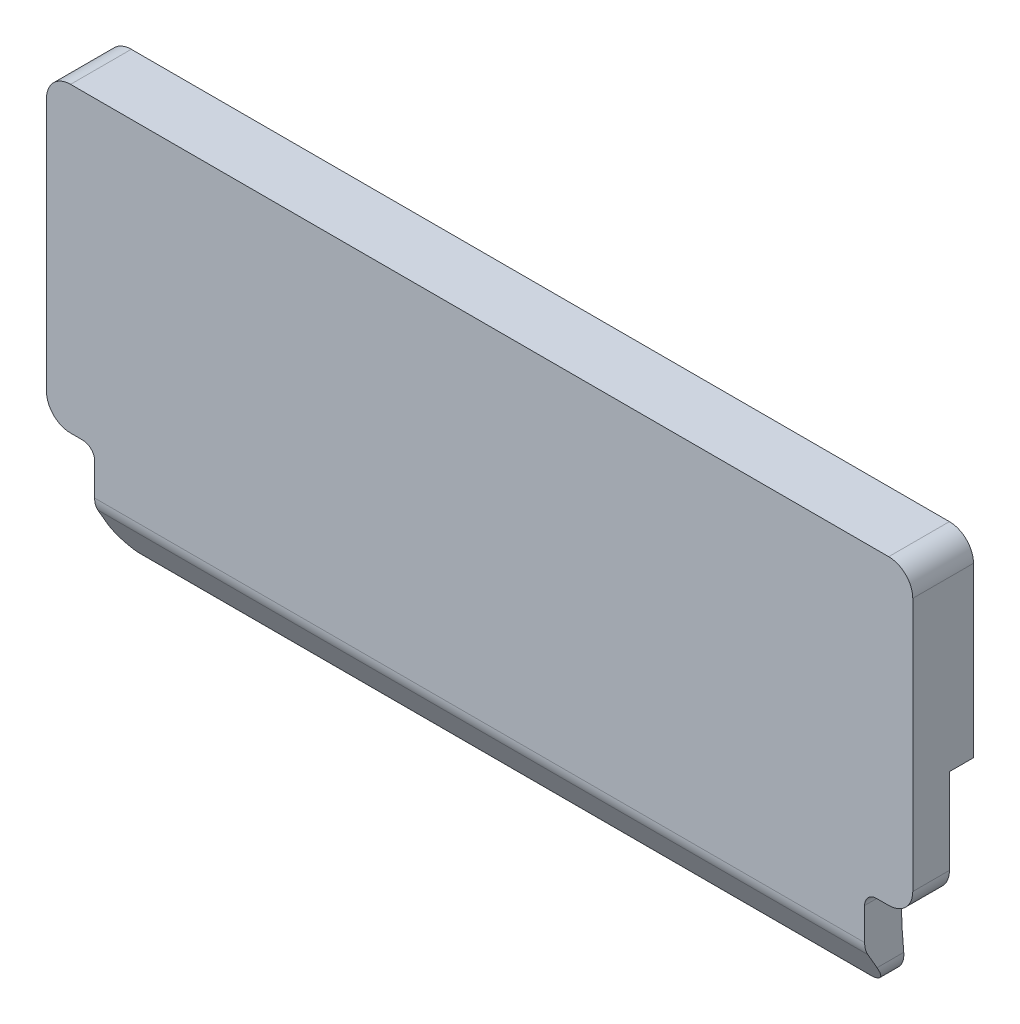
ISO-10303-21;
HEADER;
FILE_DESCRIPTION(('STEP AP214'),'2;1');
FILE_NAME('part.step','',(''),(''),'','','');
FILE_SCHEMA(('AUTOMOTIVE_DESIGN { 1 0 10303 214 1 1 1 1 }'));
ENDSEC;
DATA;
#1=APPLICATION_CONTEXT('core data for automotive mechanical design processes');
#2=APPLICATION_PROTOCOL_DEFINITION('international standard','automotive_design',2000,#1);
#3=PRODUCT_CONTEXT('',#1,'mechanical');
#4=PRODUCT('Part','Part','',(#3));
#5=PRODUCT_RELATED_PRODUCT_CATEGORY('part','',(#4));
#6=PRODUCT_DEFINITION_FORMATION('','',#4);
#7=PRODUCT_DEFINITION_CONTEXT('part definition',#1,'design');
#8=PRODUCT_DEFINITION('design','',#6,#7);
#9=PRODUCT_DEFINITION_SHAPE('','',#8);
#10=(LENGTH_UNIT() NAMED_UNIT(*) SI_UNIT(.MILLI.,.METRE.));
#11=(NAMED_UNIT(*) PLANE_ANGLE_UNIT() SI_UNIT($,.RADIAN.));
#12=(NAMED_UNIT(*) SI_UNIT($,.STERADIAN.) SOLID_ANGLE_UNIT());
#13=UNCERTAINTY_MEASURE_WITH_UNIT(LENGTH_MEASURE(1.E-05),#10,'distance_accuracy_value','');
#14=(GEOMETRIC_REPRESENTATION_CONTEXT(3) GLOBAL_UNCERTAINTY_ASSIGNED_CONTEXT((#13)) GLOBAL_UNIT_ASSIGNED_CONTEXT((#10,
#11,#12)) REPRESENTATION_CONTEXT('',''));
#15=CARTESIAN_POINT('',(0.,0.,0.));
#16=DIRECTION('',(0.,0.,1.));
#17=DIRECTION('',(1.,0.,0.));
#18=AXIS2_PLACEMENT_3D('',#15,#16,#17);
#19=CARTESIAN_POINT('',(16.9999681612747,17.3034644433608,-1.2));
#20=DIRECTION('',(0.,0.,1.));
#21=DIRECTION('',(1.,0.,0.));
#22=AXIS2_PLACEMENT_3D('',#19,#20,#21);
#23=CYLINDRICAL_SURFACE('',#22,1.);
#24=DIRECTION('',(0.,0.,1.));
#25=VECTOR('',#24,1.);
#26=CARTESIAN_POINT('',(17.9999681612747,17.3034644433608,-1.2));
#27=LINE('',#26,#25);
#28=CARTESIAN_POINT('',(17.9999681612747,17.3034644433608,-1.02379666372447));
#29=VERTEX_POINT('',#28);
#30=CARTESIAN_POINT('',(17.9999681612747,17.3034644433608,1.5));
#31=VERTEX_POINT('',#30);
#32=EDGE_CURVE('E377',#29,#31,#27,.T.);
#33=ORIENTED_EDGE('',*,*,#32,.F.);
#34=CARTESIAN_POINT('',(16.9999681612747,17.3034644433608,-1.02379666372447));
#35=DIRECTION('',(0.,0.,-1.));
#36=DIRECTION('',(-1.,0.,0.));
#37=AXIS2_PLACEMENT_3D('',#34,#35,#36);
#38=CIRCLE('',#37,1.);
#39=CARTESIAN_POINT('',(16.9999681612747,18.3034644433608,-1.02379666372447));
#40=VERTEX_POINT('',#39);
#41=EDGE_CURVE('E201',#29,#40,#38,.F.);
#42=ORIENTED_EDGE('',*,*,#41,.T.);
#43=DIRECTION('',(0.,0.,1.));
#44=VECTOR('',#43,1.);
#45=CARTESIAN_POINT('',(16.9999681612747,18.3034644433608,-1.2));
#46=LINE('',#45,#44);
#47=CARTESIAN_POINT('',(16.9999681612747,18.3034644433608,1.5));
#48=VERTEX_POINT('',#47);
#49=EDGE_CURVE('E376',#40,#48,#46,.T.);
#50=ORIENTED_EDGE('',*,*,#49,.T.);
#51=CARTESIAN_POINT('',(16.9999681612747,17.3034644433608,1.5));
#52=DIRECTION('',(0.,0.,1.));
#53=DIRECTION('',(1.,0.,0.));
#54=AXIS2_PLACEMENT_3D('',#51,#52,#53);
#55=CIRCLE('',#54,1.);
#56=EDGE_CURVE('E334',#31,#48,#55,.T.);
#57=ORIENTED_EDGE('',*,*,#56,.F.);
#58=EDGE_LOOP('',(#33,#42,#50,#57));
#59=FACE_BOUND('',#58,.T.);
#60=ADVANCED_FACE('F35',(#59),#23,.T.);
#61=CARTESIAN_POINT('',(17.9999681612747,9.3034644433608,-1.2));
#62=DIRECTION('',(1.,0.,0.));
#63=DIRECTION('',(0.,0.,-1.));
#64=AXIS2_PLACEMENT_3D('',#61,#62,#63);
#65=PLANE('',#64);
#66=DIRECTION('',(0.,0.,-1.));
#67=VECTOR('',#66,1.);
#68=CARTESIAN_POINT('',(17.9999681612747,10.3045378238837,0.));
#69=LINE('',#68,#67);
#70=CARTESIAN_POINT('',(17.9999681612747,10.3045378238837,-0.023796663724471));
#71=VERTEX_POINT('',#70);
#72=CARTESIAN_POINT('',(17.9999681612747,10.3045378238837,-1.02379666372447));
#73=VERTEX_POINT('',#72);
#74=EDGE_CURVE('E188',#71,#73,#69,.T.);
#75=ORIENTED_EDGE('',*,*,#74,.T.);
#76=DIRECTION('',(0.,1.,0.));
#77=VECTOR('',#76,1.);
#78=CARTESIAN_POINT('',(17.9999681612747,0.,-1.02379666372447));
#79=LINE('',#78,#77);
#80=EDGE_CURVE('E198',#73,#29,#79,.T.);
#81=ORIENTED_EDGE('',*,*,#80,.T.);
#82=ORIENTED_EDGE('',*,*,#32,.T.);
#83=DIRECTION('',(0.,1.,0.));
#84=VECTOR('',#83,1.);
#85=CARTESIAN_POINT('',(17.9999681612747,9.3034644433608,1.5));
#86=LINE('',#85,#84);
#87=CARTESIAN_POINT('',(17.9999681612747,6.7511744579321,1.5));
#88=VERTEX_POINT('',#87);
#89=EDGE_CURVE('E373',#88,#31,#86,.T.);
#90=ORIENTED_EDGE('',*,*,#89,.F.);
#91=DIRECTION('',(0.,0.,1.));
#92=VECTOR('',#91,1.);
#93=CARTESIAN_POINT('',(17.9999681612747,6.7511744579321,-1.2));
#94=LINE('',#93,#92);
#95=CARTESIAN_POINT('',(17.9999681612747,6.7511744579321,-0.0237966637244845));
#96=VERTEX_POINT('',#95);
#97=EDGE_CURVE('E380',#96,#88,#94,.T.);
#98=ORIENTED_EDGE('',*,*,#97,.F.);
#99=DIRECTION('',(0.,1.,0.));
#100=VECTOR('',#99,1.);
#101=CARTESIAN_POINT('',(17.9999681612747,0.,-0.0237966637245102));
#102=LINE('',#101,#100);
#103=EDGE_CURVE('E195',#96,#71,#102,.T.);
#104=ORIENTED_EDGE('',*,*,#103,.T.);
#105=EDGE_LOOP('',(#75,#81,#82,#90,#98,#104));
#106=FACE_BOUND('',#105,.T.);
#107=ADVANCED_FACE('F205',(#106),#65,.T.);
#108=CARTESIAN_POINT('',(14.9999999908967,2.7511744579321,-1.2));
#109=DIRECTION('',(0.,0.,1.));
#110=DIRECTION('',(1.,0.,0.));
#111=AXIS2_PLACEMENT_3D('',#108,#109,#110);
#112=CYLINDRICAL_SURFACE('',#111,1.);
#113=CARTESIAN_POINT('',(14.9999999908967,2.7511744579321,0.983440432817879));
#114=DIRECTION('',(0.,0.500000000000004,-0.866025403784436));
#115=DIRECTION('',(0.,0.866025403784436,0.500000000000004));
#116=AXIS2_PLACEMENT_3D('',#113,#114,#115);
#117=ELLIPSE('',#116,1.15470053837925,1.);
#118=CARTESIAN_POINT('',(15.3122498908166,1.8011744579321,0.434957677087729));
#119=VERTEX_POINT('',#118);
#120=CARTESIAN_POINT('',(15.9999999908967,2.7511744579321,0.983440432817883));
#121=VERTEX_POINT('',#120);
#122=EDGE_CURVE('E224',#119,#121,#117,.F.);
#123=ORIENTED_EDGE('',*,*,#122,.F.);
#124=CARTESIAN_POINT('',(15.3122498908166,1.8011744579321,0.434957677087729));
#125=CARTESIAN_POINT('',(15.2965038234148,1.79599923653354,0.431963906476819));
#126=CARTESIAN_POINT('',(15.2807004017838,1.79123834036473,0.428603241876576));
#127=CARTESIAN_POINT('',(15.249015061132,1.78253558103661,0.421301258666041));
#128=CARTESIAN_POINT('',(15.2331332115101,1.77859309331294,0.417360386793146));
#129=CARTESIAN_POINT('',(15.185450719724,1.76798189251516,0.404905319399466));
#130=CARTESIAN_POINT('',(15.1535508782063,1.76250915338781,0.395745682667819));
#131=CARTESIAN_POINT('',(15.0831203312076,1.7538816371229,0.374612297684159));
#132=CARTESIAN_POINT('',(15.0445607832222,1.75142484159032,0.362445126153606));
#133=CARTESIAN_POINT('',(15.0040200723801,1.75118052591928,0.349626387504528));
#134=CARTESIAN_POINT('',(15.0020099834899,1.75117446666217,0.348990740593741));
#135=CARTESIAN_POINT('',(14.9999999908967,1.7511744579321,0.348355136709285));
#136=B_SPLINE_CURVE_WITH_KNOTS('',3,(#124,#125,#126,#127,#128,#129,#130,#131,#132,#133,#134,
#135),.UNSPECIFIED.,.F.,.F.,(4,2,2,2,2,4),(0.,0.0505065234515212,0.100974360239371,
0.201710952820855,0.322939416170508,0.329263997626619),.UNSPECIFIED.);
#137=CARTESIAN_POINT('',(14.9999999908966,1.7511744579321,0.348355136709284));
#138=VERTEX_POINT('',#137);
#139=EDGE_CURVE('E327',#119,#138,#136,.T.);
#140=ORIENTED_EDGE('',*,*,#139,.T.);
#141=DIRECTION('',(0.,0.,1.));
#142=VECTOR('',#141,1.);
#143=CARTESIAN_POINT('',(14.9999999908966,1.7511744579321,-1.2));
#144=LINE('',#143,#142);
#145=CARTESIAN_POINT('',(14.9999999908966,1.7511744579321,-0.237293160280056));
#146=VERTEX_POINT('',#145);
#147=EDGE_CURVE('E392',#146,#138,#144,.T.);
#148=ORIENTED_EDGE('',*,*,#147,.F.);
#149=CARTESIAN_POINT('',(15.9999999908967,2.7511744579321,-0.125575737940101));
#150=CARTESIAN_POINT('',(15.9999997516129,2.72289910939712,-0.128179970980415));
#151=CARTESIAN_POINT('',(15.9988000147692,2.69464178760994,-0.130829965916753));
#152=CARTESIAN_POINT('',(15.9940156197121,2.63833837580376,-0.136202559755925));
#153=CARTESIAN_POINT('',(15.9904310976636,2.61029227381715,-0.138925154504984));
#154=CARTESIAN_POINT('',(15.9761365948362,2.52681825734416,-0.147165075096708));
#155=CARTESIAN_POINT('',(15.961885574281,2.4719625932454,-0.15276303268103));
#156=CARTESIAN_POINT('',(15.9243409058719,2.36544301570251,-0.163960112889909));
#157=CARTESIAN_POINT('',(15.901043299235,2.31378051107246,-0.16955923495047));
#158=CARTESIAN_POINT('',(15.8460600134313,2.21510553852121,-0.180529397411892));
#159=CARTESIAN_POINT('',(15.8143757284874,2.16809229947684,-0.185900475551305));
#160=CARTESIAN_POINT('',(15.7435062644801,2.08006219801162,-0.196172875555555));
#161=CARTESIAN_POINT('',(15.704322273831,2.0390443873601,-0.201074271662486));
#162=CARTESIAN_POINT('',(15.6195350899846,1.96417090142785,-0.210172566137797));
#163=CARTESIAN_POINT('',(15.573930774313,1.93031648112861,-0.214369341034364));
#164=CARTESIAN_POINT('',(15.4778395556464,1.87092126974996,-0.221823571551661));
#165=CARTESIAN_POINT('',(15.4273773728243,1.84534100355465,-0.225085478565456));
#166=CARTESIAN_POINT('',(15.3228283887207,1.80304154409139,-0.230521705949586));
#167=CARTESIAN_POINT('',(15.2687441357685,1.78631619316109,-0.232696782037222));
#168=CARTESIAN_POINT('',(15.1785773565084,1.76659194422358,-0.235270729268347));
#169=CARTESIAN_POINT('',(15.1430884774427,1.76081410408441,-0.236027770447802));
#170=CARTESIAN_POINT('',(15.0717383520385,1.75310592844471,-0.237039334396501));
#171=CARTESIAN_POINT('',(15.0358776923015,1.75117025247139,-0.237294554674457));
#172=CARTESIAN_POINT('',(14.9999999908966,1.7511744579321,-0.237293160280061));
#173=B_SPLINE_CURVE_WITH_KNOTS('',3,(#149,#150,#151,#152,#153,#154,#155,#156,#157,#158,#159,
#160,#161,#162,#163,#164,#165,#166,#167,#168,#169,#170,#171,#172),.UNSPECIFIED.,.F.,.F.,(4,2,2,
2,2,2,2,2,2,2,2,4),(0.,0.0851324676359856,0.17026007485209,0.34024152918921,0.510297451330853,
0.680325120672268,0.850325869450747,1.02035637668983,1.18956329304109,1.35865238870991,
1.46634905537268,1.57389592234497),.UNSPECIFIED.);
#174=CARTESIAN_POINT('',(15.9999999908967,2.7511744579321,-0.125575737940101));
#175=VERTEX_POINT('',#174);
#176=EDGE_CURVE('E290',#175,#146,#173,.T.);
#177=ORIENTED_EDGE('',*,*,#176,.F.);
#178=DIRECTION('',(0.,0.,1.));
#179=VECTOR('',#178,1.);
#180=CARTESIAN_POINT('',(15.9999999908967,2.7511744579321,-1.2));
#181=LINE('',#180,#179);
#182=EDGE_CURVE('E389',#175,#121,#181,.T.);
#183=ORIENTED_EDGE('',*,*,#182,.T.);
#184=EDGE_LOOP('',(#123,#140,#148,#177,#183));
#185=FACE_BOUND('',#184,.T.);
#186=ADVANCED_FACE('F319',(#185),#112,.T.);
#187=CARTESIAN_POINT('',(-14.9999999908967,2.7511744579321,-1.2));
#188=DIRECTION('',(0.,0.,1.));
#189=DIRECTION('',(1.,0.,0.));
#190=AXIS2_PLACEMENT_3D('',#187,#188,#189);
#191=CYLINDRICAL_SURFACE('',#190,1.);
#192=DIRECTION('',(0.,0.,1.));
#193=VECTOR('',#192,1.);
#194=CARTESIAN_POINT('',(-14.9999999908966,1.7511744579321,-1.2));
#195=LINE('',#194,#193);
#196=CARTESIAN_POINT('',(-14.9999999908967,1.7511744579321,-0.237293160280056));
#197=VERTEX_POINT('',#196);
#198=CARTESIAN_POINT('',(-14.9999999908967,1.7511744579321,0.348355136709284));
#199=VERTEX_POINT('',#198);
#200=EDGE_CURVE('E395',#197,#199,#195,.T.);
#201=ORIENTED_EDGE('',*,*,#200,.T.);
#202=CARTESIAN_POINT('',(-15.3122498908166,1.8011744579321,0.434957677087729));
#203=CARTESIAN_POINT('',(-15.2965038234148,1.79599923653354,0.431963906476818));
#204=CARTESIAN_POINT('',(-15.2807004017838,1.79123834036473,0.428603241876576));
#205=CARTESIAN_POINT('',(-15.249015061132,1.78253558103661,0.421301258666041));
#206=CARTESIAN_POINT('',(-15.2331332115101,1.77859309331294,0.417360386793146));
#207=CARTESIAN_POINT('',(-15.185450719724,1.76798189251516,0.404905319399465));
#208=CARTESIAN_POINT('',(-15.1535508782063,1.76250915338781,0.395745682667818));
#209=CARTESIAN_POINT('',(-15.0831203312076,1.7538816371229,0.374612297684159));
#210=CARTESIAN_POINT('',(-15.0445607832222,1.75142484159032,0.362445126153608));
#211=CARTESIAN_POINT('',(-15.0040200723801,1.75118052591928,0.349626387504528));
#212=CARTESIAN_POINT('',(-15.0020099834899,1.75117446666217,0.348990740593741));
#213=CARTESIAN_POINT('',(-14.9999999908967,1.7511744579321,0.348355136709285));
#214=B_SPLINE_CURVE_WITH_KNOTS('',3,(#202,#203,#204,#205,#206,#207,#208,#209,#210,#211,#212,
#213),.UNSPECIFIED.,.F.,.F.,(4,2,2,2,2,4),(0.,0.0505065234515196,0.100974360239371,
0.201710952820855,0.322939416170506,0.329263997626618),.UNSPECIFIED.);
#215=CARTESIAN_POINT('',(-15.3122498908166,1.8011744579321,0.434957677087729));
#216=VERTEX_POINT('',#215);
#217=EDGE_CURVE('E420',#199,#216,#214,.F.);
#218=ORIENTED_EDGE('',*,*,#217,.T.);
#219=CARTESIAN_POINT('',(-14.9999999908967,2.7511744579321,0.983440432817879));
#220=DIRECTION('',(0.,0.500000000000004,-0.866025403784436));
#221=DIRECTION('',(0.,0.866025403784436,0.500000000000004));
#222=AXIS2_PLACEMENT_3D('',#219,#220,#221);
#223=ELLIPSE('',#222,1.15470053837925,1.);
#224=CARTESIAN_POINT('',(-15.9999999908967,2.7511744579321,0.983440432817883));
#225=VERTEX_POINT('',#224);
#226=EDGE_CURVE('E221',#225,#216,#223,.F.);
#227=ORIENTED_EDGE('',*,*,#226,.F.);
#228=DIRECTION('',(0.,0.,1.));
#229=VECTOR('',#228,1.);
#230=CARTESIAN_POINT('',(-15.9999999908967,2.7511744579321,-1.2));
#231=LINE('',#230,#229);
#232=CARTESIAN_POINT('',(-15.9999999908967,2.7511744579321,-0.125575737940101));
#233=VERTEX_POINT('',#232);
#234=EDGE_CURVE('E398',#233,#225,#231,.T.);
#235=ORIENTED_EDGE('',*,*,#234,.F.);
#236=CARTESIAN_POINT('',(-14.9999999908966,1.7511744579321,-0.23729316028006));
#237=CARTESIAN_POINT('',(-15.0279755218537,1.75117451259731,-0.237293418045667));
#238=CARTESIAN_POINT('',(-15.0559375726446,1.75234914851384,-0.237138766892222));
#239=CARTESIAN_POINT('',(-15.1116599205576,1.75703437024343,-0.236523638943896));
#240=CARTESIAN_POINT('',(-15.1394202315626,1.7605447937491,-0.236063183398518));
#241=CARTESIAN_POINT('',(-15.2220360208037,1.7745421779764,-0.234231420253824));
#242=CARTESIAN_POINT('',(-15.2763354499483,1.78849537100947,-0.232409684228025));
#243=CARTESIAN_POINT('',(-15.3817956035086,1.82523937135603,-0.227662322394163));
#244=CARTESIAN_POINT('',(-15.4329551408678,1.84803349749352,-0.22473628204917));
#245=CARTESIAN_POINT('',(-15.5307153695212,1.90179177725756,-0.217935072231445));
#246=CARTESIAN_POINT('',(-15.5773164701636,1.93275519635564,-0.21405998809266));
#247=CARTESIAN_POINT('',(-15.6648622818307,2.00211422406037,-0.205538120590874));
#248=CARTESIAN_POINT('',(-15.7057815243501,2.04054155480835,-0.200888055926904));
#249=CARTESIAN_POINT('',(-15.780609995894,2.12365931454169,-0.191051519117248));
#250=CARTESIAN_POINT('',(-15.8145176835034,2.16835111708828,-0.185864929397475));
#251=CARTESIAN_POINT('',(-15.8746135712874,2.26309363016117,-0.175149989364954));
#252=CARTESIAN_POINT('',(-15.9007413677809,2.3131823602586,-0.169619348371503));
#253=CARTESIAN_POINT('',(-15.9441954419023,2.41702142356663,-0.158485648935339));
#254=CARTESIAN_POINT('',(-15.9615264663249,2.47076976423075,-0.152882631225021));
#255=CARTESIAN_POINT('',(-15.9827816879702,2.56253973553881,-0.143619780660668));
#256=CARTESIAN_POINT('',(-15.9892329044462,2.5999918745674,-0.139920541362453));
#257=CARTESIAN_POINT('',(-15.9978418379543,2.67534626469952,-0.132644711640458));
#258=CARTESIAN_POINT('',(-16.0000053358987,2.71324784035339,-0.129067962476211));
#259=CARTESIAN_POINT('',(-15.9999999908967,2.7511744579321,-0.125575737940099));
#260=B_SPLINE_CURVE_WITH_KNOTS('',3,(#236,#237,#238,#239,#240,#241,#242,#243,#244,#245,#246,
#247,#248,#249,#250,#251,#252,#253,#254,#255,#256,#257,#258,#259),.UNSPECIFIED.,.F.,.F.,(4,2,2,
2,2,2,2,2,2,2,2,4),(0.,0.0838747821322791,0.167743736647363,0.335158547577951,0.502636265770589,
0.67009893061016,0.838289544220954,1.00651709351317,1.17601861748151,1.34542857983896,
1.45974941947321,1.57391602100178),.UNSPECIFIED.);
#261=EDGE_CURVE('E283',#197,#233,#260,.T.);
#262=ORIENTED_EDGE('',*,*,#261,.F.);
#263=EDGE_LOOP('',(#201,#218,#227,#235,#262));
#264=FACE_BOUND('',#263,.T.);
#265=ADVANCED_FACE('F323',(#264),#191,.T.);
#266=CARTESIAN_POINT('',(-17.9999999908966,9.30453782438948,-1.2));
#267=DIRECTION('',(-1.,0.,0.));
#268=DIRECTION('',(0.,0.,1.));
#269=AXIS2_PLACEMENT_3D('',#266,#267,#268);
#270=PLANE('',#269);
#271=DIRECTION('',(0.,0.,1.));
#272=VECTOR('',#271,1.);
#273=CARTESIAN_POINT('',(-17.9999999908967,17.3034644433608,-1.2));
#274=LINE('',#273,#272);
#275=CARTESIAN_POINT('',(-17.9999999908967,17.3034644433608,-1.02379666372447));
#276=VERTEX_POINT('',#275);
#277=CARTESIAN_POINT('',(-17.9999999908967,17.3034644433608,1.5));
#278=VERTEX_POINT('',#277);
#279=EDGE_CURVE('E409',#276,#278,#274,.T.);
#280=ORIENTED_EDGE('',*,*,#279,.F.);
#281=DIRECTION('',(0.,-1.,0.));
#282=VECTOR('',#281,1.);
#283=CARTESIAN_POINT('',(-17.9999999908966,9.30453782438948,-1.02379666372447));
#284=LINE('',#283,#282);
#285=CARTESIAN_POINT('',(-17.9999999908966,10.3045378238837,-1.02379666372447));
#286=VERTEX_POINT('',#285);
#287=EDGE_CURVE('E232',#276,#286,#284,.T.);
#288=ORIENTED_EDGE('',*,*,#287,.T.);
#289=DIRECTION('',(0.,0.,1.));
#290=VECTOR('',#289,1.);
#291=CARTESIAN_POINT('',(-17.9999999908966,10.3045378238837,-1.2));
#292=LINE('',#291,#290);
#293=CARTESIAN_POINT('',(-17.9999999908966,10.3045378238837,-0.023796663724471));
#294=VERTEX_POINT('',#293);
#295=EDGE_CURVE('E191',#286,#294,#292,.T.);
#296=ORIENTED_EDGE('',*,*,#295,.T.);
#297=DIRECTION('',(0.,-1.,0.));
#298=VECTOR('',#297,1.);
#299=CARTESIAN_POINT('',(-17.9999999908966,9.30453782438948,-0.0237966637244749));
#300=LINE('',#299,#298);
#301=CARTESIAN_POINT('',(-17.9999999908966,6.7511744579321,-0.0237966637244846));
#302=VERTEX_POINT('',#301);
#303=EDGE_CURVE('E416',#294,#302,#300,.T.);
#304=ORIENTED_EDGE('',*,*,#303,.T.);
#305=DIRECTION('',(0.,0.,1.));
#306=VECTOR('',#305,1.);
#307=CARTESIAN_POINT('',(-17.9999999908966,6.7511744579321,-1.2));
#308=LINE('',#307,#306);
#309=CARTESIAN_POINT('',(-17.9999999908966,6.7511744579321,1.5));
#310=VERTEX_POINT('',#309);
#311=EDGE_CURVE('E407',#302,#310,#308,.T.);
#312=ORIENTED_EDGE('',*,*,#311,.T.);
#313=DIRECTION('',(0.,-1.,0.));
#314=VECTOR('',#313,1.);
#315=CARTESIAN_POINT('',(-17.9999999908966,10.3045060210661,1.5));
#316=LINE('',#315,#314);
#317=EDGE_CURVE('E348',#278,#310,#316,.T.);
#318=ORIENTED_EDGE('',*,*,#317,.F.);
#319=EDGE_LOOP('',(#280,#288,#296,#304,#312,#318));
#320=FACE_BOUND('',#319,.T.);
#321=ADVANCED_FACE('F436',(#320),#270,.T.);
#322=CARTESIAN_POINT('',(-16.9999999908967,17.3034644433608,-1.2));
#323=DIRECTION('',(0.,0.,1.));
#324=DIRECTION('',(1.,0.,0.));
#325=AXIS2_PLACEMENT_3D('',#322,#323,#324);
#326=CYLINDRICAL_SURFACE('',#325,1.);
#327=DIRECTION('',(0.,0.,1.));
#328=VECTOR('',#327,1.);
#329=CARTESIAN_POINT('',(-16.9999999908967,18.3034644433608,-1.2));
#330=LINE('',#329,#328);
#331=CARTESIAN_POINT('',(-16.9999999908967,18.3034644433608,-1.02379666372447));
#332=VERTEX_POINT('',#331);
#333=CARTESIAN_POINT('',(-16.9999999908967,18.3034644433608,1.5));
#334=VERTEX_POINT('',#333);
#335=EDGE_CURVE('E411',#332,#334,#330,.T.);
#336=ORIENTED_EDGE('',*,*,#335,.F.);
#337=CARTESIAN_POINT('',(-16.9999999908967,17.3034644433608,-1.02379666372447));
#338=DIRECTION('',(0.,0.,-1.));
#339=DIRECTION('',(-1.,0.,0.));
#340=AXIS2_PLACEMENT_3D('',#337,#338,#339);
#341=CIRCLE('',#340,1.);
#342=EDGE_CURVE('E229',#332,#276,#341,.F.);
#343=ORIENTED_EDGE('',*,*,#342,.T.);
#344=ORIENTED_EDGE('',*,*,#279,.T.);
#345=CARTESIAN_POINT('',(-16.9999999908967,17.3034644433608,1.5));
#346=DIRECTION('',(0.,0.,1.));
#347=DIRECTION('',(-1.,0.,0.));
#348=AXIS2_PLACEMENT_3D('',#345,#346,#347);
#349=CIRCLE('',#348,1.);
#350=EDGE_CURVE('E345',#334,#278,#349,.T.);
#351=ORIENTED_EDGE('',*,*,#350,.F.);
#352=EDGE_LOOP('',(#336,#343,#344,#351));
#353=FACE_BOUND('',#352,.T.);
#354=ADVANCED_FACE('F458',(#353),#326,.T.);
#355=CARTESIAN_POINT('',(16.9999681612747,18.3034644433608,-1.2));
#356=DIRECTION('',(0.,1.,0.));
#357=DIRECTION('',(0.,0.,1.));
#358=AXIS2_PLACEMENT_3D('',#355,#356,#357);
#359=PLANE('',#358);
#360=ORIENTED_EDGE('',*,*,#49,.F.);
#361=DIRECTION('',(-1.,0.,0.));
#362=VECTOR('',#361,1.);
#363=CARTESIAN_POINT('',(16.9999681612747,18.3034644433608,-1.02379666372447));
#364=LINE('',#363,#362);
#365=EDGE_CURVE('E379',#40,#332,#364,.T.);
#366=ORIENTED_EDGE('',*,*,#365,.T.);
#367=ORIENTED_EDGE('',*,*,#335,.T.);
#368=DIRECTION('',(-1.,0.,0.));
#369=VECTOR('',#368,1.);
#370=CARTESIAN_POINT('',(16.9999681612747,18.3034644433608,1.5));
#371=LINE('',#370,#369);
#372=EDGE_CURVE('E342',#48,#334,#371,.T.);
#373=ORIENTED_EDGE('',*,*,#372,.F.);
#374=EDGE_LOOP('',(#360,#366,#367,#373));
#375=FACE_BOUND('',#374,.T.);
#376=ADVANCED_FACE('F454',(#375),#359,.T.);
#377=CARTESIAN_POINT('',(16.9999681612747,6.7511744579321,-1.2));
#378=DIRECTION('',(0.,0.,1.));
#379=DIRECTION('',(1.,0.,0.));
#380=AXIS2_PLACEMENT_3D('',#377,#378,#379);
#381=CYLINDRICAL_SURFACE('',#380,0.999999999999998);
#382=CARTESIAN_POINT('',(17.0819158255048,5.75453782388375,-0.0237966637244916));
#383=CARTESIAN_POINT('',(17.0682808921052,5.75341693831545,-0.023769688496642));
#384=CARTESIAN_POINT('',(17.0546344533862,5.75257621503533,-0.0237494624790333));
#385=CARTESIAN_POINT('',(17.0273185653095,5.75145509305145,-0.0237225088642976));
#386=CARTESIAN_POINT('',(17.0136491159518,5.75117469434768,-0.0237157812671707));
#387=CARTESIAN_POINT('',(16.9999681612747,5.7511744579321,-0.0237158028802847));
#388=B_SPLINE_CURVE_WITH_KNOTS('',3,(#382,#383,#384,#385,#386,#387),.UNSPECIFIED.,.F.,.F.,(4,2,
4),(0.,0.0410169797758226,0.0820339595516748),.UNSPECIFIED.);
#389=CARTESIAN_POINT('',(17.0819158255048,5.75453782388375,-0.0237966637244884));
#390=VERTEX_POINT('',#389);
#391=CARTESIAN_POINT('',(16.9999681612747,5.75117445793196,-0.0237158028802836));
#392=VERTEX_POINT('',#391);
#393=EDGE_CURVE('E335',#390,#392,#388,.T.);
#394=ORIENTED_EDGE('',*,*,#393,.F.);
#395=CARTESIAN_POINT('',(16.9999681612747,6.7511744579321,-0.0237966637244846));
#396=DIRECTION('',(0.,0.,-1.));
#397=DIRECTION('',(0.,1.,0.));
#398=AXIS2_PLACEMENT_3D('',#395,#396,#397);
#399=CIRCLE('',#398,0.999999999999998);
#400=EDGE_CURVE('E238',#390,#96,#399,.F.);
#401=ORIENTED_EDGE('',*,*,#400,.T.);
#402=ORIENTED_EDGE('',*,*,#97,.T.);
#403=CARTESIAN_POINT('',(16.9999681612747,6.7511744579321,1.5));
#404=DIRECTION('',(0.,0.,1.));
#405=DIRECTION('',(-1.,0.,0.));
#406=AXIS2_PLACEMENT_3D('',#403,#404,#405);
#407=CIRCLE('',#406,0.999999999999998);
#408=CARTESIAN_POINT('',(16.9999681612747,5.7511744579321,1.5));
#409=VERTEX_POINT('',#408);
#410=EDGE_CURVE('E370',#409,#88,#407,.T.);
#411=ORIENTED_EDGE('',*,*,#410,.F.);
#412=DIRECTION('',(0.,0.,1.));
#413=VECTOR('',#412,1.);
#414=CARTESIAN_POINT('',(16.9999681612747,5.7511744579321,-1.2));
#415=LINE('',#414,#413);
#416=EDGE_CURVE('E382',#392,#409,#415,.T.);
#417=ORIENTED_EDGE('',*,*,#416,.F.);
#418=EDGE_LOOP('',(#394,#401,#402,#411,#417));
#419=FACE_BOUND('',#418,.T.);
#420=ADVANCED_FACE('F457',(#419),#381,.T.);
#421=CARTESIAN_POINT('',(16.9999681612747,5.7511744579321,-1.2));
#422=DIRECTION('',(0.,-1.,0.));
#423=DIRECTION('',(1.,0.,0.));
#424=AXIS2_PLACEMENT_3D('',#421,#422,#423);
#425=PLANE('',#424);
#426=DIRECTION('',(1.,0.,0.));
#427=VECTOR('',#426,1.);
#428=CARTESIAN_POINT('',(-22.0000318387253,5.75117445793196,-0.0237158028802836));
#429=LINE('',#428,#427);
#430=CARTESIAN_POINT('',(16.4999999908967,5.7511744579321,-0.0237158028802871));
#431=VERTEX_POINT('',#430);
#432=EDGE_CURVE('E305',#392,#431,#429,.F.);
#433=ORIENTED_EDGE('',*,*,#432,.F.);
#434=ORIENTED_EDGE('',*,*,#416,.T.);
#435=DIRECTION('',(1.,0.,0.));
#436=VECTOR('',#435,1.);
#437=CARTESIAN_POINT('',(16.9999681612747,5.7511744579321,1.5));
#438=LINE('',#437,#436);
#439=CARTESIAN_POINT('',(16.4999999908967,5.7511744579321,1.5));
#440=VERTEX_POINT('',#439);
#441=EDGE_CURVE('E367',#440,#409,#438,.T.);
#442=ORIENTED_EDGE('',*,*,#441,.F.);
#443=DIRECTION('',(0.,0.,1.));
#444=VECTOR('',#443,1.);
#445=CARTESIAN_POINT('',(16.4999999908967,5.7511744579321,-1.2));
#446=LINE('',#445,#444);
#447=EDGE_CURVE('E384',#431,#440,#446,.T.);
#448=ORIENTED_EDGE('',*,*,#447,.F.);
#449=EDGE_LOOP('',(#433,#434,#442,#448));
#450=FACE_BOUND('',#449,.T.);
#451=ADVANCED_FACE('F313',(#450),#425,.T.);
#452=CARTESIAN_POINT('',(16.4999999908967,5.2511744579321,-1.2));
#453=DIRECTION('',(0.,0.,1.));
#454=DIRECTION('',(1.,0.,0.));
#455=AXIS2_PLACEMENT_3D('',#452,#453,#454);
#456=CYLINDRICAL_SURFACE('',#455,0.5);
#457=CARTESIAN_POINT('',(16.4999999908967,5.7511744579321,-0.0237158028802871));
#458=CARTESIAN_POINT('',(16.471875384531,5.75119836962264,-0.0237176793137748));
#459=CARTESIAN_POINT('',(16.4437579985598,5.74880290983789,-0.0236589619411988));
#460=CARTESIAN_POINT('',(16.3883405645314,5.73934980214081,-0.0234342090898313));
#461=CARTESIAN_POINT('',(16.3610398840156,5.73229586487482,-0.0232682590280332));
#462=CARTESIAN_POINT('',(16.3079989092569,5.71369741912025,-0.0228427681967311));
#463=CARTESIAN_POINT('',(16.2822593636163,5.70215077564307,-0.022583182934926));
#464=CARTESIAN_POINT('',(16.2330881326508,5.67490493020884,-0.021995772738433));
#465=CARTESIAN_POINT('',(16.2096560509919,5.65920644309267,-0.0216679595529097));
#466=CARTESIAN_POINT('',(16.1657557995455,5.6240968032948,-0.020974591205691));
#467=CARTESIAN_POINT('',(16.1452881131671,5.6046850462787,-0.0206090299049555));
#468=CARTESIAN_POINT('',(16.1078977420164,5.56269669604653,-0.0198736962056207));
#469=CARTESIAN_POINT('',(16.0909757527434,5.54011948336357,-0.0195039229958123));
#470=CARTESIAN_POINT('',(16.0611570736685,5.49243815287769,-0.0187928706056048));
#471=CARTESIAN_POINT('',(16.0482618425387,5.46733312373143,-0.0184516017834865));
#472=CARTESIAN_POINT('',(16.0268761364908,5.41531866747497,-0.0178263808703688));
#473=CARTESIAN_POINT('',(16.0183830765849,5.38841030980076,-0.0175423952022588));
#474=CARTESIAN_POINT('',(16.0081522720924,5.34297700292384,-0.0171369469419324));
#475=CARTESIAN_POINT('',(16.0050970484248,5.3247380336047,-0.0169931359716457));
#476=CARTESIAN_POINT('',(16.0010211664306,5.28806011408813,-0.0167429722536724));
#477=CARTESIAN_POINT('',(15.9999976343451,5.26962148350216,-0.0166365667728736));
#478=CARTESIAN_POINT('',(15.9999999908967,5.25117445793209,-0.0165503711782082));
#479=B_SPLINE_CURVE_WITH_KNOTS('',3,(#457,#458,#459,#460,#461,#462,#463,#464,#465,#466,#467,
#468,#469,#470,#471,#472,#473,#474,#475,#476,#477,#478),.UNSPECIFIED.,.F.,.F.,(4,2,2,2,2,2,2,2,
2,2,4),(0.,0.0842615660288163,0.16845609548457,0.252690684166668,0.336910779246166,
0.421144592819399,0.505394913678191,0.589675718464712,0.673906976704528,0.729282502685622,
0.78457964588962),.UNSPECIFIED.);
#480=CARTESIAN_POINT('',(15.9999999908966,5.25117445793209,-0.0165503711782068));
#481=VERTEX_POINT('',#480);
#482=EDGE_CURVE('E298',#431,#481,#479,.T.);
#483=ORIENTED_EDGE('',*,*,#482,.F.);
#484=ORIENTED_EDGE('',*,*,#447,.T.);
#485=CARTESIAN_POINT('',(16.4999999908967,5.2511744579321,1.5));
#486=DIRECTION('',(0.,0.,-1.));
#487=DIRECTION('',(-1.,0.,0.));
#488=AXIS2_PLACEMENT_3D('',#485,#486,#487);
#489=CIRCLE('',#488,0.5);
#490=CARTESIAN_POINT('',(15.9999999908967,5.25117445793209,1.5));
#491=VERTEX_POINT('',#490);
#492=EDGE_CURVE('E364',#491,#440,#489,.T.);
#493=ORIENTED_EDGE('',*,*,#492,.F.);
#494=DIRECTION('',(0.,0.,1.));
#495=VECTOR('',#494,1.);
#496=CARTESIAN_POINT('',(15.9999999908967,5.25117445793209,-1.2));
#497=LINE('',#496,#495);
#498=EDGE_CURVE('E386',#481,#491,#497,.T.);
#499=ORIENTED_EDGE('',*,*,#498,.F.);
#500=EDGE_LOOP('',(#483,#484,#493,#499));
#501=FACE_BOUND('',#500,.T.);
#502=ADVANCED_FACE('F307',(#501),#456,.F.);
#503=CARTESIAN_POINT('',(15.9999999908967,5.25117445793209,-1.2));
#504=DIRECTION('',(1.,0.,0.));
#505=DIRECTION('',(0.,0.,-1.));
#506=AXIS2_PLACEMENT_3D('',#503,#504,#505);
#507=PLANE('',#506);
#508=DIRECTION('',(0.,1.,0.));
#509=VECTOR('',#508,1.);
#510=CARTESIAN_POINT('',(15.9999999908967,5.25117445793209,1.5));
#511=LINE('',#510,#509);
#512=CARTESIAN_POINT('',(15.9999999908967,3.91383106585843,1.5));
#513=VERTEX_POINT('',#512);
#514=EDGE_CURVE('E362',#513,#491,#511,.T.);
#515=ORIENTED_EDGE('',*,*,#514,.F.);
#516=CARTESIAN_POINT('',(15.9999999908966,3.91383106585843,0.5));
#517=DIRECTION('',(1.,0.,0.));
#518=DIRECTION('',(0.,0.,-1.));
#519=AXIS2_PLACEMENT_3D('',#516,#517,#518);
#520=CIRCLE('',#519,1.);
#521=CARTESIAN_POINT('',(15.9999999908967,3.41383106585843,1.36602540378444));
#522=VERTEX_POINT('',#521);
#523=EDGE_CURVE('E11',#513,#522,#520,.T.);
#524=ORIENTED_EDGE('',*,*,#523,.T.);
#525=DIRECTION('',(0.,0.866025403784436,0.500000000000004));
#526=VECTOR('',#525,1.);
#527=CARTESIAN_POINT('',(15.9999999908967,3.68071701669689,1.52011207934395));
#528=LINE('',#527,#526);
#529=EDGE_CURVE('E226',#121,#522,#528,.T.);
#530=ORIENTED_EDGE('',*,*,#529,.F.);
#531=ORIENTED_EDGE('',*,*,#182,.F.);
#532=CARTESIAN_POINT('',(15.9999999908966,5.12962199757055,-25.9468654745351));
#533=DIRECTION('',(1.,0.,0.));
#534=DIRECTION('',(0.,0.,-1.));
#535=AXIS2_PLACEMENT_3D('',#532,#533,#534);
#536=CIRCLE('',#535,25.9306);
#537=EDGE_CURVE('E306',#481,#175,#536,.T.);
#538=ORIENTED_EDGE('',*,*,#537,.F.);
#539=ORIENTED_EDGE('',*,*,#498,.T.);
#540=EDGE_LOOP('',(#515,#524,#530,#531,#538,#539));
#541=FACE_BOUND('',#540,.T.);
#542=ADVANCED_FACE('F312',(#541),#507,.T.);
#543=CARTESIAN_POINT('',(14.9999999908966,1.7511744579321,-1.2));
#544=DIRECTION('',(0.,-1.,0.));
#545=DIRECTION('',(0.,0.,-1.));
#546=AXIS2_PLACEMENT_3D('',#543,#544,#545);
#547=PLANE('',#546);
#548=DIRECTION('',(1.,0.,0.));
#549=VECTOR('',#548,1.);
#550=CARTESIAN_POINT('',(-22.0000318387253,1.7511744579321,0.348355136709284));
#551=LINE('',#550,#549);
#552=EDGE_CURVE('E222',#199,#138,#551,.T.);
#553=ORIENTED_EDGE('',*,*,#552,.F.);
#554=ORIENTED_EDGE('',*,*,#200,.F.);
#555=DIRECTION('',(1.,0.,0.));
#556=VECTOR('',#555,1.);
#557=CARTESIAN_POINT('',(-22.0000318387253,1.7511744579321,-0.237293160280056));
#558=LINE('',#557,#556);
#559=EDGE_CURVE('E211',#197,#146,#558,.T.);
#560=ORIENTED_EDGE('',*,*,#559,.T.);
#561=ORIENTED_EDGE('',*,*,#147,.T.);
#562=EDGE_LOOP('',(#553,#554,#560,#561));
#563=FACE_BOUND('',#562,.T.);
#564=ADVANCED_FACE('F317',(#563),#547,.T.);
#565=CARTESIAN_POINT('',(-15.9999999908967,5.25117445793209,-1.2));
#566=DIRECTION('',(-1.,0.,0.));
#567=DIRECTION('',(0.,0.,1.));
#568=AXIS2_PLACEMENT_3D('',#565,#566,#567);
#569=PLANE('',#568);
#570=DIRECTION('',(0.,-0.866025403784436,-0.500000000000004));
#571=VECTOR('',#570,1.);
#572=CARTESIAN_POINT('',(-15.9999999908967,3.68071701669689,1.52011207934395));
#573=LINE('',#572,#571);
#574=CARTESIAN_POINT('',(-15.9999999908967,3.41383106585843,1.36602540378444));
#575=VERTEX_POINT('',#574);
#576=EDGE_CURVE('E219',#575,#225,#573,.T.);
#577=ORIENTED_EDGE('',*,*,#576,.F.);
#578=CARTESIAN_POINT('',(-15.9999999908967,3.91383106585843,0.5));
#579=DIRECTION('',(-1.,0.,0.));
#580=DIRECTION('',(0.,0.,1.));
#581=AXIS2_PLACEMENT_3D('',#578,#579,#580);
#582=CIRCLE('',#581,1.);
#583=CARTESIAN_POINT('',(-15.9999999908967,3.91383106585843,1.5));
#584=VERTEX_POINT('',#583);
#585=EDGE_CURVE('E57',#575,#584,#582,.T.);
#586=ORIENTED_EDGE('',*,*,#585,.T.);
#587=DIRECTION('',(0.,-1.,0.));
#588=VECTOR('',#587,1.);
#589=CARTESIAN_POINT('',(-15.9999999908967,5.25117445793209,1.5));
#590=LINE('',#589,#588);
#591=CARTESIAN_POINT('',(-15.9999999908967,5.25117445793209,1.5));
#592=VERTEX_POINT('',#591);
#593=EDGE_CURVE('E360',#592,#584,#590,.T.);
#594=ORIENTED_EDGE('',*,*,#593,.F.);
#595=DIRECTION('',(0.,0.,1.));
#596=VECTOR('',#595,1.);
#597=CARTESIAN_POINT('',(-15.9999999908967,5.25117445793209,-1.2));
#598=LINE('',#597,#596);
#599=CARTESIAN_POINT('',(-15.9999999908967,5.25117445793209,-0.0165503711782068));
#600=VERTEX_POINT('',#599);
#601=EDGE_CURVE('E401',#600,#592,#598,.T.);
#602=ORIENTED_EDGE('',*,*,#601,.F.);
#603=CARTESIAN_POINT('',(-15.9999999908967,5.12962199757055,-25.9468654745351));
#604=DIRECTION('',(-1.,0.,0.));
#605=DIRECTION('',(0.,0.,1.));
#606=AXIS2_PLACEMENT_3D('',#603,#604,#605);
#607=CIRCLE('',#606,25.9306);
#608=EDGE_CURVE('E251',#233,#600,#607,.T.);
#609=ORIENTED_EDGE('',*,*,#608,.F.);
#610=ORIENTED_EDGE('',*,*,#234,.T.);
#611=EDGE_LOOP('',(#577,#586,#594,#602,#609,#610));
#612=FACE_BOUND('',#611,.T.);
#613=ADVANCED_FACE('F437',(#612),#569,.T.);
#614=CARTESIAN_POINT('',(-16.4999999908967,5.2511744579321,-1.2));
#615=DIRECTION('',(0.,0.,1.));
#616=DIRECTION('',(1.,0.,0.));
#617=AXIS2_PLACEMENT_3D('',#614,#615,#616);
#618=CYLINDRICAL_SURFACE('',#617,0.5);
#619=CARTESIAN_POINT('',(-15.9999999908967,5.25117445793209,-0.0165503711782068));
#620=CARTESIAN_POINT('',(-15.999976098191,5.2793027384635,-0.0166804630413799));
#621=CARTESIAN_POINT('',(-16.0023721590893,5.3074235593633,-0.0168597681712694));
#622=CARTESIAN_POINT('',(-16.0118275466337,5.3628474410801,-0.0173000075543428));
#623=CARTESIAN_POINT('',(-16.018883174385,5.39015113260074,-0.0175608769730842));
#624=CARTESIAN_POINT('',(-16.0374859890604,5.4431976027104,-0.0181478460773247));
#625=CARTESIAN_POINT('',(-16.0490353101597,5.46893963289987,-0.0184739767213282));
#626=CARTESIAN_POINT('',(-16.0762875079888,5.51811523462596,-0.0191642080552818));
#627=CARTESIAN_POINT('',(-16.0919896679209,5.54154920358669,-0.0195283021860098));
#628=CARTESIAN_POINT('',(-16.1271071236014,5.58545178141471,-0.0202629388260564));
#629=CARTESIAN_POINT('',(-16.1465229128269,5.6059199955484,-0.0206334821864111));
#630=CARTESIAN_POINT('',(-16.1885200249764,5.64331052379946,-0.0213473313065091));
#631=CARTESIAN_POINT('',(-16.2111019650759,5.66023214497359,-0.0216906317353256));
#632=CARTESIAN_POINT('',(-16.258790019066,5.69004690422539,-0.0223179656074168));
#633=CARTESIAN_POINT('',(-16.2838967110997,5.70293911681927,-0.0226019854300171));
#634=CARTESIAN_POINT('',(-16.3359140664016,5.72431853513455,-0.0230835853428311));
#635=CARTESIAN_POINT('',(-16.3628236582997,5.73280833122216,-0.0232812162531977));
#636=CARTESIAN_POINT('',(-16.4082483658526,5.74303129616568,-0.0235215204330944));
#637=CARTESIAN_POINT('',(-16.4264774733681,5.74608311900675,-0.0235940919900735));
#638=CARTESIAN_POINT('',(-16.463135164898,5.75015443944078,-0.0236913435168322));
#639=CARTESIAN_POINT('',(-16.4815634298255,5.75117680931413,-0.0237160911703622));
#640=CARTESIAN_POINT('',(-16.4999999908967,5.7511744579321,-0.0237158028802856));
#641=B_SPLINE_CURVE_WITH_KNOTS('',3,(#619,#620,#621,#622,#623,#624,#625,#626,#627,#628,#629,
#630,#631,#632,#633,#634,#635,#636,#637,#638,#639,#640),.UNSPECIFIED.,.F.,.F.,(4,2,2,2,2,2,2,2,
2,2,4),(0.,0.0842734680935671,0.168480117829147,0.252726808468181,0.33695896725023,
0.42120232681738,0.505462130774784,0.589741273518916,0.673970770285553,0.729314346057007,
0.784579538180128),.UNSPECIFIED.);
#642=CARTESIAN_POINT('',(-16.4999999908967,5.7511744579321,-0.0237158028802871));
#643=VERTEX_POINT('',#642);
#644=EDGE_CURVE('E243',#600,#643,#641,.T.);
#645=ORIENTED_EDGE('',*,*,#644,.F.);
#646=ORIENTED_EDGE('',*,*,#601,.T.);
#647=CARTESIAN_POINT('',(-16.4999999908967,5.2511744579321,1.5));
#648=DIRECTION('',(0.,0.,-1.));
#649=DIRECTION('',(1.,0.,0.));
#650=AXIS2_PLACEMENT_3D('',#647,#648,#649);
#651=CIRCLE('',#650,0.5);
#652=CARTESIAN_POINT('',(-16.4999999908967,5.7511744579321,1.5));
#653=VERTEX_POINT('',#652);
#654=EDGE_CURVE('E357',#653,#592,#651,.T.);
#655=ORIENTED_EDGE('',*,*,#654,.F.);
#656=DIRECTION('',(0.,0.,1.));
#657=VECTOR('',#656,1.);
#658=CARTESIAN_POINT('',(-16.4999999908967,5.7511744579321,-1.2));
#659=LINE('',#658,#657);
#660=EDGE_CURVE('E403',#643,#653,#659,.T.);
#661=ORIENTED_EDGE('',*,*,#660,.F.);
#662=EDGE_LOOP('',(#645,#646,#655,#661));
#663=FACE_BOUND('',#662,.T.);
#664=ADVANCED_FACE('F253',(#663),#618,.F.);
#665=CARTESIAN_POINT('',(-16.9999999908966,5.7511744579321,-1.2));
#666=DIRECTION('',(0.,-1.,0.));
#667=DIRECTION('',(0.,0.,-1.));
#668=AXIS2_PLACEMENT_3D('',#665,#666,#667);
#669=PLANE('',#668);
#670=DIRECTION('',(1.,0.,0.));
#671=VECTOR('',#670,1.);
#672=CARTESIAN_POINT('',(-22.0000318387253,5.7511744579321,-0.0237158028802871));
#673=LINE('',#672,#671);
#674=CARTESIAN_POINT('',(-16.9999999908966,5.75117445793209,-0.0237158028802871));
#675=VERTEX_POINT('',#674);
#676=EDGE_CURVE('E241',#643,#675,#673,.F.);
#677=ORIENTED_EDGE('',*,*,#676,.F.);
#678=ORIENTED_EDGE('',*,*,#660,.T.);
#679=DIRECTION('',(1.,0.,0.));
#680=VECTOR('',#679,1.);
#681=CARTESIAN_POINT('',(-16.9999999908966,5.7511744579321,1.5));
#682=LINE('',#681,#680);
#683=CARTESIAN_POINT('',(-16.9999999908966,5.7511744579321,1.5));
#684=VERTEX_POINT('',#683);
#685=EDGE_CURVE('E354',#684,#653,#682,.T.);
#686=ORIENTED_EDGE('',*,*,#685,.F.);
#687=DIRECTION('',(0.,0.,1.));
#688=VECTOR('',#687,1.);
#689=CARTESIAN_POINT('',(-16.9999999908966,5.7511744579321,-1.2));
#690=LINE('',#689,#688);
#691=EDGE_CURVE('E405',#675,#684,#690,.T.);
#692=ORIENTED_EDGE('',*,*,#691,.F.);
#693=EDGE_LOOP('',(#677,#678,#686,#692));
#694=FACE_BOUND('',#693,.T.);
#695=ADVANCED_FACE('F444',(#694),#669,.T.);
#696=CARTESIAN_POINT('',(-16.9999999908966,6.7511744579321,-1.2));
#697=DIRECTION('',(0.,0.,1.));
#698=DIRECTION('',(1.,0.,0.));
#699=AXIS2_PLACEMENT_3D('',#696,#697,#698);
#700=CYLINDRICAL_SURFACE('',#699,1.);
#701=CARTESIAN_POINT('',(-16.9999999908966,5.75117445793209,-0.0237158028802871));
#702=CARTESIAN_POINT('',(-17.0136809455737,5.75117469434768,-0.0237157812671728));
#703=CARTESIAN_POINT('',(-17.0273503949315,5.75145509305145,-0.0237225088642993));
#704=CARTESIAN_POINT('',(-17.0546662830082,5.75257621503533,-0.0237494624790343));
#705=CARTESIAN_POINT('',(-17.0683127217272,5.75341693831545,-0.0237696884966426));
#706=CARTESIAN_POINT('',(-17.0819476551268,5.75453782388375,-0.0237966637244919));
#707=B_SPLINE_CURVE_WITH_KNOTS('',3,(#701,#702,#703,#704,#705,#706),.UNSPECIFIED.,.F.,.F.,(4,2,
4),(0.,0.0410169797758766,0.08203395955172),.UNSPECIFIED.);
#708=CARTESIAN_POINT('',(-17.0819476551268,5.75453782388375,-0.0237966637244884));
#709=VERTEX_POINT('',#708);
#710=EDGE_CURVE('E271',#675,#709,#707,.T.);
#711=ORIENTED_EDGE('',*,*,#710,.F.);
#712=ORIENTED_EDGE('',*,*,#691,.T.);
#713=CARTESIAN_POINT('',(-16.9999999908966,6.7511744579321,1.5));
#714=DIRECTION('',(0.,0.,1.));
#715=DIRECTION('',(1.,0.,0.));
#716=AXIS2_PLACEMENT_3D('',#713,#714,#715);
#717=CIRCLE('',#716,1.);
#718=EDGE_CURVE('E351',#310,#684,#717,.T.);
#719=ORIENTED_EDGE('',*,*,#718,.F.);
#720=ORIENTED_EDGE('',*,*,#311,.F.);
#721=CARTESIAN_POINT('',(-16.9999999908966,6.7511744579321,-0.0237966637244846));
#722=DIRECTION('',(0.,0.,-1.));
#723=DIRECTION('',(0.,1.,0.));
#724=AXIS2_PLACEMENT_3D('',#721,#722,#723);
#725=CIRCLE('',#724,1.);
#726=EDGE_CURVE('E235',#302,#709,#725,.F.);
#727=ORIENTED_EDGE('',*,*,#726,.T.);
#728=EDGE_LOOP('',(#711,#712,#719,#720,#727));
#729=FACE_BOUND('',#728,.T.);
#730=ADVANCED_FACE('F464',(#729),#700,.T.);
#731=CARTESIAN_POINT('',(16.9999681612747,17.3034644433608,1.5));
#732=DIRECTION('',(0.,0.,1.));
#733=DIRECTION('',(1.,0.,0.));
#734=AXIS2_PLACEMENT_3D('',#731,#732,#733);
#735=PLANE('',#734);
#736=ORIENTED_EDGE('',*,*,#593,.T.);
#737=DIRECTION('',(-1.,0.,0.));
#738=VECTOR('',#737,1.);
#739=CARTESIAN_POINT('',(15.9999999908966,3.91383106585843,1.5));
#740=LINE('',#739,#738);
#741=EDGE_CURVE('E43',#584,#513,#740,.F.);
#742=ORIENTED_EDGE('',*,*,#741,.T.);
#743=ORIENTED_EDGE('',*,*,#514,.T.);
#744=ORIENTED_EDGE('',*,*,#492,.T.);
#745=ORIENTED_EDGE('',*,*,#441,.T.);
#746=ORIENTED_EDGE('',*,*,#410,.T.);
#747=ORIENTED_EDGE('',*,*,#89,.T.);
#748=ORIENTED_EDGE('',*,*,#56,.T.);
#749=ORIENTED_EDGE('',*,*,#372,.T.);
#750=ORIENTED_EDGE('',*,*,#350,.T.);
#751=ORIENTED_EDGE('',*,*,#317,.T.);
#752=ORIENTED_EDGE('',*,*,#718,.T.);
#753=ORIENTED_EDGE('',*,*,#685,.T.);
#754=ORIENTED_EDGE('',*,*,#654,.T.);
#755=EDGE_LOOP('',(#736,#742,#743,#744,#745,#746,#747,#748,#749,#750,#751,#752,#753,#754));
#756=FACE_BOUND('',#755,.T.);
#757=ADVANCED_FACE('F467',(#756),#735,.T.);
#758=CARTESIAN_POINT('',(-22.0000318387253,1.8511744579321,0.348355136709285));
#759=DIRECTION('',(1.,0.,0.));
#760=DIRECTION('',(0.,0.,-1.));
#761=AXIS2_PLACEMENT_3D('',#758,#759,#760);
#762=CYLINDRICAL_SURFACE('',#761,0.1);
#763=DIRECTION('',(1.,0.,0.));
#764=VECTOR('',#763,1.);
#765=CARTESIAN_POINT('',(-22.0000318387253,1.8011744579321,0.434957677087729));
#766=LINE('',#765,#764);
#767=EDGE_CURVE('E214',#216,#119,#766,.T.);
#768=ORIENTED_EDGE('',*,*,#767,.F.);
#769=ORIENTED_EDGE('',*,*,#217,.F.);
#770=ORIENTED_EDGE('',*,*,#552,.T.);
#771=ORIENTED_EDGE('',*,*,#139,.F.);
#772=EDGE_LOOP('',(#768,#769,#770,#771));
#773=FACE_BOUND('',#772,.T.);
#774=ADVANCED_FACE('F264',(#773),#762,.T.);
#775=CARTESIAN_POINT('',(-22.0000318387253,0.261951415518509,-0.453713160792639));
#776=DIRECTION('',(0.,0.500000000000004,-0.866025403784436));
#777=DIRECTION('',(0.,0.866025403784436,0.500000000000004));
#778=AXIS2_PLACEMENT_3D('',#775,#776,#777);
#779=PLANE('',#778);
#780=ORIENTED_EDGE('',*,*,#529,.T.);
#781=DIRECTION('',(-1.,0.,0.));
#782=VECTOR('',#781,1.);
#783=CARTESIAN_POINT('',(-15.9999999908966,3.41383106585843,1.36602540378444));
#784=LINE('',#783,#782);
#785=EDGE_CURVE('E424',#522,#575,#784,.T.);
#786=ORIENTED_EDGE('',*,*,#785,.T.);
#787=ORIENTED_EDGE('',*,*,#576,.T.);
#788=ORIENTED_EDGE('',*,*,#226,.T.);
#789=ORIENTED_EDGE('',*,*,#767,.T.);
#790=ORIENTED_EDGE('',*,*,#122,.T.);
#791=EDGE_LOOP('',(#780,#786,#787,#788,#789,#790));
#792=FACE_BOUND('',#791,.T.);
#793=ADVANCED_FACE('F487',(#792),#779,.F.);
#794=CARTESIAN_POINT('',(-22.0000318387253,0.,-1.02379666372447));
#795=DIRECTION('',(0.,0.,-1.));
#796=DIRECTION('',(-1.,0.,0.));
#797=AXIS2_PLACEMENT_3D('',#794,#795,#796);
#798=PLANE('',#797);
#799=ORIENTED_EDGE('',*,*,#80,.F.);
#800=DIRECTION('',(1.,0.,0.));
#801=VECTOR('',#800,1.);
#802=CARTESIAN_POINT('',(-22.0000318387253,10.3045378238837,-1.02379666372447));
#803=LINE('',#802,#801);
#804=EDGE_CURVE('E183',#286,#73,#803,.T.);
#805=ORIENTED_EDGE('',*,*,#804,.F.);
#806=ORIENTED_EDGE('',*,*,#287,.F.);
#807=ORIENTED_EDGE('',*,*,#342,.F.);
#808=ORIENTED_EDGE('',*,*,#365,.F.);
#809=ORIENTED_EDGE('',*,*,#41,.F.);
#810=EDGE_LOOP('',(#799,#805,#806,#807,#808,#809));
#811=FACE_BOUND('',#810,.T.);
#812=ADVANCED_FACE('F199',(#811),#798,.T.);
#813=CARTESIAN_POINT('',(-22.0000318387253,5.12962199757055,-25.9468654745351));
#814=DIRECTION('',(1.,0.,0.));
#815=DIRECTION('',(0.,0.,-1.));
#816=AXIS2_PLACEMENT_3D('',#813,#814,#815);
#817=CYLINDRICAL_SURFACE('',#816,25.9306);
#818=ORIENTED_EDGE('',*,*,#393,.T.);
#819=ORIENTED_EDGE('',*,*,#432,.T.);
#820=ORIENTED_EDGE('',*,*,#482,.T.);
#821=ORIENTED_EDGE('',*,*,#537,.T.);
#822=ORIENTED_EDGE('',*,*,#176,.T.);
#823=ORIENTED_EDGE('',*,*,#559,.F.);
#824=ORIENTED_EDGE('',*,*,#261,.T.);
#825=ORIENTED_EDGE('',*,*,#608,.T.);
#826=ORIENTED_EDGE('',*,*,#644,.T.);
#827=ORIENTED_EDGE('',*,*,#676,.T.);
#828=ORIENTED_EDGE('',*,*,#710,.T.);
#829=DIRECTION('',(1.,0.,0.));
#830=VECTOR('',#829,1.);
#831=CARTESIAN_POINT('',(-22.0000318387253,5.75453782388375,-0.0237966637244883));
#832=LINE('',#831,#830);
#833=EDGE_CURVE('E215',#709,#390,#832,.T.);
#834=ORIENTED_EDGE('',*,*,#833,.T.);
#835=EDGE_LOOP('',(#818,#819,#820,#821,#822,#823,#824,#825,#826,#827,#828,#834));
#836=FACE_BOUND('',#835,.T.);
#837=ADVANCED_FACE('F257',(#836),#817,.F.);
#838=CARTESIAN_POINT('',(-22.0000318387253,0.,-0.0237966637245102));
#839=DIRECTION('',(0.,0.,-1.));
#840=DIRECTION('',(0.,1.,0.));
#841=AXIS2_PLACEMENT_3D('',#838,#839,#840);
#842=PLANE('',#841);
#843=ORIENTED_EDGE('',*,*,#833,.F.);
#844=ORIENTED_EDGE('',*,*,#726,.F.);
#845=ORIENTED_EDGE('',*,*,#303,.F.);
#846=DIRECTION('',(1.,0.,0.));
#847=VECTOR('',#846,1.);
#848=CARTESIAN_POINT('',(-22.0000318387253,10.3045378238837,-0.023796663724471));
#849=LINE('',#848,#847);
#850=EDGE_CURVE('E194',#294,#71,#849,.T.);
#851=ORIENTED_EDGE('',*,*,#850,.T.);
#852=ORIENTED_EDGE('',*,*,#103,.F.);
#853=ORIENTED_EDGE('',*,*,#400,.F.);
#854=EDGE_LOOP('',(#843,#844,#845,#851,#852,#853));
#855=FACE_BOUND('',#854,.T.);
#856=ADVANCED_FACE('F262',(#855),#842,.T.);
#857=CARTESIAN_POINT('',(-22.0000318387253,10.3045378238837,0.));
#858=DIRECTION('',(0.,-1.,0.));
#859=DIRECTION('',(0.,0.,-1.));
#860=AXIS2_PLACEMENT_3D('',#857,#858,#859);
#861=PLANE('',#860);
#862=ORIENTED_EDGE('',*,*,#804,.T.);
#863=ORIENTED_EDGE('',*,*,#74,.F.);
#864=ORIENTED_EDGE('',*,*,#850,.F.);
#865=ORIENTED_EDGE('',*,*,#295,.F.);
#866=EDGE_LOOP('',(#862,#863,#864,#865));
#867=FACE_BOUND('',#866,.T.);
#868=ADVANCED_FACE('F185',(#867),#861,.T.);
#869=CARTESIAN_POINT('',(-22.0000318387253,3.91383106585843,0.5));
#870=DIRECTION('',(1.,0.,0.));
#871=DIRECTION('',(0.,0.,-1.));
#872=AXIS2_PLACEMENT_3D('',#869,#870,#871);
#873=CYLINDRICAL_SURFACE('',#872,1.);
#874=ORIENTED_EDGE('',*,*,#523,.F.);
#875=ORIENTED_EDGE('',*,*,#741,.F.);
#876=ORIENTED_EDGE('',*,*,#585,.F.);
#877=ORIENTED_EDGE('',*,*,#785,.F.);
#878=EDGE_LOOP('',(#874,#875,#876,#877));
#879=FACE_BOUND('',#878,.T.);
#880=ADVANCED_FACE('F37',(#879),#873,.T.);
#881=CLOSED_SHELL('',(#60,#107,#186,#265,#321,#354,#376,#420,#451,#502,#542,#564,#613,#664,#695,
#730,#757,#774,#793,#812,#837,#856,#868,#880));
#882=MANIFOLD_SOLID_BREP('B2',#881);
#883=ADVANCED_BREP_SHAPE_REPRESENTATION('',(#18,#882),#14);
#884=SHAPE_DEFINITION_REPRESENTATION(#9,#883);
ENDSEC;
END-ISO-10303-21;
